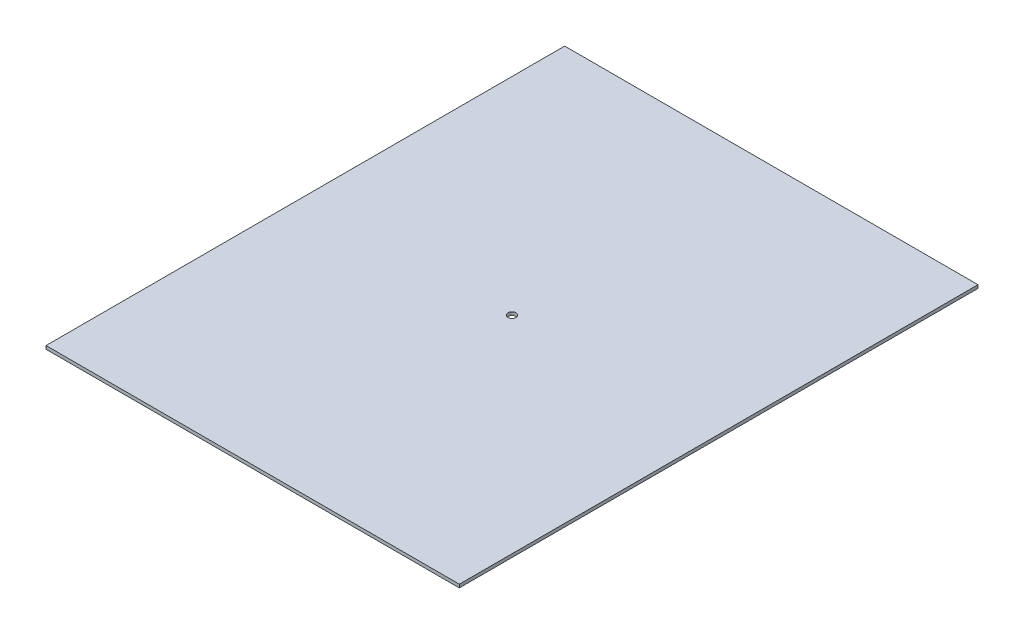
ISO-10303-21;
HEADER;
FILE_DESCRIPTION(('STEP AP214'),'2;1');
FILE_NAME('part.step','',(''),(''),'','','');
FILE_SCHEMA(('AUTOMOTIVE_DESIGN { 1 0 10303 214 1 1 1 1 }'));
ENDSEC;
DATA;
#1=APPLICATION_CONTEXT('core data for automotive mechanical design processes');
#2=APPLICATION_PROTOCOL_DEFINITION('international standard','automotive_design',2000,#1);
#3=PRODUCT_CONTEXT('',#1,'mechanical');
#4=PRODUCT('Part','Part','',(#3));
#5=PRODUCT_RELATED_PRODUCT_CATEGORY('part','',(#4));
#6=PRODUCT_DEFINITION_FORMATION('','',#4);
#7=PRODUCT_DEFINITION_CONTEXT('part definition',#1,'design');
#8=PRODUCT_DEFINITION('design','',#6,#7);
#9=PRODUCT_DEFINITION_SHAPE('','',#8);
#10=(LENGTH_UNIT() NAMED_UNIT(*) SI_UNIT(.MILLI.,.METRE.));
#11=(NAMED_UNIT(*) PLANE_ANGLE_UNIT() SI_UNIT($,.RADIAN.));
#12=(NAMED_UNIT(*) SI_UNIT($,.STERADIAN.) SOLID_ANGLE_UNIT());
#13=UNCERTAINTY_MEASURE_WITH_UNIT(LENGTH_MEASURE(1.E-05),#10,'distance_accuracy_value','');
#14=(GEOMETRIC_REPRESENTATION_CONTEXT(3) GLOBAL_UNCERTAINTY_ASSIGNED_CONTEXT((#13)) GLOBAL_UNIT_ASSIGNED_CONTEXT((#10,
#11,#12)) REPRESENTATION_CONTEXT('',''));
#15=CARTESIAN_POINT('',(0.,0.,0.));
#16=DIRECTION('',(0.,0.,1.));
#17=DIRECTION('',(1.,0.,0.));
#18=AXIS2_PLACEMENT_3D('',#15,#16,#17);
#19=CARTESIAN_POINT('',(0.,2.,0.));
#20=DIRECTION('',(0.,1.,0.));
#21=DIRECTION('',(0.,0.,1.));
#22=AXIS2_PLACEMENT_3D('',#19,#20,#21);
#23=PLANE('',#22);
#24=DIRECTION('',(0.,0.,1.));
#25=VECTOR('',#24,1.);
#26=CARTESIAN_POINT('',(-87.1307314266501,2.,-175.234375));
#27=LINE('',#26,#25);
#28=CARTESIAN_POINT('',(-87.1307314266501,2.,-175.234375));
#29=VERTEX_POINT('',#28);
#30=CARTESIAN_POINT('',(-87.1307314266501,2.,144.765625));
#31=VERTEX_POINT('',#30);
#32=EDGE_CURVE('E85',#29,#31,#27,.T.);
#33=ORIENTED_EDGE('',*,*,#32,.T.);
#34=DIRECTION('',(1.,0.,0.));
#35=VECTOR('',#34,1.);
#36=CARTESIAN_POINT('',(-87.1307314266501,2.,144.765625));
#37=LINE('',#36,#35);
#38=CARTESIAN_POINT('',(167.86926857335,2.,144.765625));
#39=VERTEX_POINT('',#38);
#40=EDGE_CURVE('E80',#31,#39,#37,.T.);
#41=ORIENTED_EDGE('',*,*,#40,.T.);
#42=DIRECTION('',(0.,0.,-1.));
#43=VECTOR('',#42,1.);
#44=CARTESIAN_POINT('',(167.86926857335,2.,-175.234375));
#45=LINE('',#44,#43);
#46=CARTESIAN_POINT('',(167.86926857335,2.,-175.234375));
#47=VERTEX_POINT('',#46);
#48=EDGE_CURVE('E83',#39,#47,#45,.T.);
#49=ORIENTED_EDGE('',*,*,#48,.T.);
#50=DIRECTION('',(-1.,0.,0.));
#51=VECTOR('',#50,1.);
#52=CARTESIAN_POINT('',(-87.1307314266501,2.,-175.234375));
#53=LINE('',#52,#51);
#54=EDGE_CURVE('E50',#47,#29,#53,.T.);
#55=ORIENTED_EDGE('',*,*,#54,.T.);
#56=EDGE_LOOP('',(#33,#41,#49,#55));
#57=FACE_BOUND('',#56,.T.);
#58=CARTESIAN_POINT('',(40.3692685733499,2.,-15.234375));
#59=DIRECTION('',(0.,1.,0.));
#60=DIRECTION('',(0.,0.,1.));
#61=AXIS2_PLACEMENT_3D('',#58,#59,#60);
#62=CIRCLE('',#61,2.5);
#63=CARTESIAN_POINT('',(40.3692685733499,2.,-12.734375));
#64=VERTEX_POINT('',#63);
#65=EDGE_CURVE('E100',#64,#64,#62,.T.);
#66=ORIENTED_EDGE('',*,*,#65,.F.);
#67=EDGE_LOOP('',(#66));
#68=FACE_BOUND('',#67,.T.);
#69=ADVANCED_FACE('F33',(#57,#68),#23,.T.);
#70=CARTESIAN_POINT('',(0.,0.,0.));
#71=DIRECTION('',(0.,1.,0.));
#72=DIRECTION('',(0.,0.,1.));
#73=AXIS2_PLACEMENT_3D('',#70,#71,#72);
#74=PLANE('',#73);
#75=DIRECTION('',(0.,0.,1.));
#76=VECTOR('',#75,1.);
#77=CARTESIAN_POINT('',(-87.1307314266501,0.,-175.234375));
#78=LINE('',#77,#76);
#79=CARTESIAN_POINT('',(-87.1307314266501,0.,-175.234375));
#80=VERTEX_POINT('',#79);
#81=CARTESIAN_POINT('',(-87.1307314266501,0.,144.765625));
#82=VERTEX_POINT('',#81);
#83=EDGE_CURVE('E97',#80,#82,#78,.T.);
#84=ORIENTED_EDGE('',*,*,#83,.F.);
#85=DIRECTION('',(-1.,0.,0.));
#86=VECTOR('',#85,1.);
#87=CARTESIAN_POINT('',(-87.1307314266501,0.,-175.234375));
#88=LINE('',#87,#86);
#89=CARTESIAN_POINT('',(167.86926857335,0.,-175.234375));
#90=VERTEX_POINT('',#89);
#91=EDGE_CURVE('E73',#90,#80,#88,.T.);
#92=ORIENTED_EDGE('',*,*,#91,.F.);
#93=DIRECTION('',(0.,0.,-1.));
#94=VECTOR('',#93,1.);
#95=CARTESIAN_POINT('',(167.86926857335,0.,-175.234375));
#96=LINE('',#95,#94);
#97=CARTESIAN_POINT('',(167.86926857335,0.,144.765625));
#98=VERTEX_POINT('',#97);
#99=EDGE_CURVE('E67',#98,#90,#96,.T.);
#100=ORIENTED_EDGE('',*,*,#99,.F.);
#101=DIRECTION('',(1.,0.,0.));
#102=VECTOR('',#101,1.);
#103=CARTESIAN_POINT('',(-87.1307314266501,0.,144.765625));
#104=LINE('',#103,#102);
#105=EDGE_CURVE('E89',#82,#98,#104,.T.);
#106=ORIENTED_EDGE('',*,*,#105,.F.);
#107=EDGE_LOOP('',(#84,#92,#100,#106));
#108=FACE_BOUND('',#107,.T.);
#109=CARTESIAN_POINT('',(40.3692685733499,0.,-15.234375));
#110=DIRECTION('',(0.,1.,0.));
#111=DIRECTION('',(0.,0.,1.));
#112=AXIS2_PLACEMENT_3D('',#109,#110,#111);
#113=CIRCLE('',#112,2.5);
#114=CARTESIAN_POINT('',(40.3692685733499,0.,-12.734375));
#115=VERTEX_POINT('',#114);
#116=EDGE_CURVE('E112',#115,#115,#113,.T.);
#117=ORIENTED_EDGE('',*,*,#116,.T.);
#118=EDGE_LOOP('',(#117));
#119=FACE_BOUND('',#118,.T.);
#120=ADVANCED_FACE('F108',(#108,#119),#74,.F.);
#121=CARTESIAN_POINT('',(-87.1307314266501,2.,-175.234375));
#122=DIRECTION('',(1.,0.,0.));
#123=DIRECTION('',(0.,0.,-1.));
#124=AXIS2_PLACEMENT_3D('',#121,#122,#123);
#125=PLANE('',#124);
#126=ORIENTED_EDGE('',*,*,#83,.T.);
#127=DIRECTION('',(0.,-1.,0.));
#128=VECTOR('',#127,1.);
#129=CARTESIAN_POINT('',(-87.1307314266501,2.,144.765625));
#130=LINE('',#129,#128);
#131=EDGE_CURVE('E11',#31,#82,#130,.T.);
#132=ORIENTED_EDGE('',*,*,#131,.F.);
#133=ORIENTED_EDGE('',*,*,#32,.F.);
#134=DIRECTION('',(0.,-1.,0.));
#135=VECTOR('',#134,1.);
#136=CARTESIAN_POINT('',(-87.1307314266501,2.,-175.234375));
#137=LINE('',#136,#135);
#138=EDGE_CURVE('E93',#29,#80,#137,.T.);
#139=ORIENTED_EDGE('',*,*,#138,.T.);
#140=EDGE_LOOP('',(#126,#132,#133,#139));
#141=FACE_BOUND('',#140,.T.);
#142=ADVANCED_FACE('F35',(#141),#125,.F.);
#143=CARTESIAN_POINT('',(-87.1307314266501,2.,144.765625));
#144=DIRECTION('',(0.,0.,-1.));
#145=DIRECTION('',(-1.,0.,0.));
#146=AXIS2_PLACEMENT_3D('',#143,#144,#145);
#147=PLANE('',#146);
#148=ORIENTED_EDGE('',*,*,#105,.T.);
#149=DIRECTION('',(0.,-1.,0.));
#150=VECTOR('',#149,1.);
#151=CARTESIAN_POINT('',(167.86926857335,2.,144.765625));
#152=LINE('',#151,#150);
#153=EDGE_CURVE('E42',#39,#98,#152,.T.);
#154=ORIENTED_EDGE('',*,*,#153,.F.);
#155=ORIENTED_EDGE('',*,*,#40,.F.);
#156=ORIENTED_EDGE('',*,*,#131,.T.);
#157=EDGE_LOOP('',(#148,#154,#155,#156));
#158=FACE_BOUND('',#157,.T.);
#159=ADVANCED_FACE('F88',(#158),#147,.F.);
#160=CARTESIAN_POINT('',(167.86926857335,2.,-175.234375));
#161=DIRECTION('',(-1.,0.,0.));
#162=DIRECTION('',(0.,0.,1.));
#163=AXIS2_PLACEMENT_3D('',#160,#161,#162);
#164=PLANE('',#163);
#165=ORIENTED_EDGE('',*,*,#99,.T.);
#166=DIRECTION('',(0.,-1.,0.));
#167=VECTOR('',#166,1.);
#168=CARTESIAN_POINT('',(167.86926857335,2.,-175.234375));
#169=LINE('',#168,#167);
#170=EDGE_CURVE('E90',#47,#90,#169,.T.);
#171=ORIENTED_EDGE('',*,*,#170,.F.);
#172=ORIENTED_EDGE('',*,*,#48,.F.);
#173=ORIENTED_EDGE('',*,*,#153,.T.);
#174=EDGE_LOOP('',(#165,#171,#172,#173));
#175=FACE_BOUND('',#174,.T.);
#176=ADVANCED_FACE('F91',(#175),#164,.F.);
#177=CARTESIAN_POINT('',(-87.1307314266501,2.,-175.234375));
#178=DIRECTION('',(0.,0.,1.));
#179=DIRECTION('',(1.,0.,0.));
#180=AXIS2_PLACEMENT_3D('',#177,#178,#179);
#181=PLANE('',#180);
#182=ORIENTED_EDGE('',*,*,#91,.T.);
#183=ORIENTED_EDGE('',*,*,#138,.F.);
#184=ORIENTED_EDGE('',*,*,#54,.F.);
#185=ORIENTED_EDGE('',*,*,#170,.T.);
#186=EDGE_LOOP('',(#182,#183,#184,#185));
#187=FACE_BOUND('',#186,.T.);
#188=ADVANCED_FACE('F105',(#187),#181,.F.);
#189=CARTESIAN_POINT('',(40.3692685733499,2.,-15.234375));
#190=DIRECTION('',(0.,-1.,0.));
#191=DIRECTION('',(0.,0.,-1.));
#192=AXIS2_PLACEMENT_3D('',#189,#190,#191);
#193=CYLINDRICAL_SURFACE('',#192,2.5);
#194=ORIENTED_EDGE('',*,*,#65,.T.);
#195=EDGE_LOOP('',(#194));
#196=FACE_BOUND('',#195,.T.);
#197=ORIENTED_EDGE('',*,*,#116,.F.);
#198=EDGE_LOOP('',(#197));
#199=FACE_BOUND('',#198,.T.);
#200=ADVANCED_FACE('F118',(#196,#199),#193,.F.);
#201=CLOSED_SHELL('',(#69,#120,#142,#159,#176,#188,#200));
#202=MANIFOLD_SOLID_BREP('B2',#201);
#203=ADVANCED_BREP_SHAPE_REPRESENTATION('',(#18,#202),#14);
#204=SHAPE_DEFINITION_REPRESENTATION(#9,#203);
ENDSEC;
END-ISO-10303-21;
